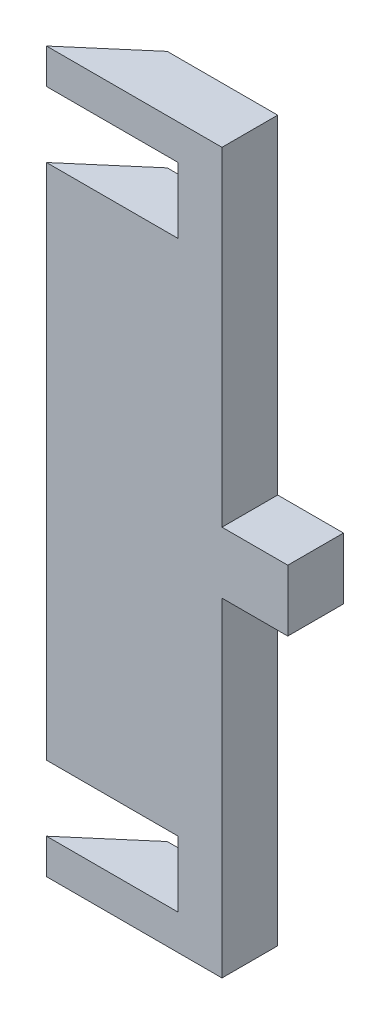
ISO-10303-21;
HEADER;
FILE_DESCRIPTION(('STEP AP214'),'2;1');
FILE_NAME('part.step','',(''),(''),'','','');
FILE_SCHEMA(('AUTOMOTIVE_DESIGN { 1 0 10303 214 1 1 1 1 }'));
ENDSEC;
DATA;
#1=APPLICATION_CONTEXT('core data for automotive mechanical design processes');
#2=APPLICATION_PROTOCOL_DEFINITION('international standard','automotive_design',2000,#1);
#3=PRODUCT_CONTEXT('',#1,'mechanical');
#4=PRODUCT('Part','Part','',(#3));
#5=PRODUCT_RELATED_PRODUCT_CATEGORY('part','',(#4));
#6=PRODUCT_DEFINITION_FORMATION('','',#4);
#7=PRODUCT_DEFINITION_CONTEXT('part definition',#1,'design');
#8=PRODUCT_DEFINITION('design','',#6,#7);
#9=PRODUCT_DEFINITION_SHAPE('','',#8);
#10=(LENGTH_UNIT() NAMED_UNIT(*) SI_UNIT(.MILLI.,.METRE.));
#11=(NAMED_UNIT(*) PLANE_ANGLE_UNIT() SI_UNIT($,.RADIAN.));
#12=(NAMED_UNIT(*) SI_UNIT($,.STERADIAN.) SOLID_ANGLE_UNIT());
#13=UNCERTAINTY_MEASURE_WITH_UNIT(LENGTH_MEASURE(1.E-05),#10,'distance_accuracy_value','');
#14=(GEOMETRIC_REPRESENTATION_CONTEXT(3) GLOBAL_UNCERTAINTY_ASSIGNED_CONTEXT((#13)) GLOBAL_UNIT_ASSIGNED_CONTEXT((#10,
#11,#12)) REPRESENTATION_CONTEXT('',''));
#15=CARTESIAN_POINT('',(0.,0.,0.));
#16=DIRECTION('',(0.,0.,1.));
#17=DIRECTION('',(1.,0.,0.));
#18=AXIS2_PLACEMENT_3D('',#15,#16,#17);
#19=CARTESIAN_POINT('',(60.,170.,0.));
#20=DIRECTION('',(0.,0.,-1.));
#21=DIRECTION('',(-1.,0.,0.));
#22=AXIS2_PLACEMENT_3D('',#19,#20,#21);
#23=PLANE('',#22);
#24=DIRECTION('',(-1.,0.,0.));
#25=VECTOR('',#24,1.);
#26=CARTESIAN_POINT('',(0.,81.,0.));
#27=LINE('',#26,#25);
#28=CARTESIAN_POINT('',(55.,81.,0.));
#29=VERTEX_POINT('',#28);
#30=CARTESIAN_POINT('',(40.,81.,0.));
#31=VERTEX_POINT('',#30);
#32=EDGE_CURVE('E233',#29,#31,#27,.T.);
#33=ORIENTED_EDGE('',*,*,#32,.F.);
#34=DIRECTION('',(0.,-1.,0.));
#35=VECTOR('',#34,1.);
#36=CARTESIAN_POINT('',(55.,95.,0.));
#37=LINE('',#36,#35);
#38=CARTESIAN_POINT('',(55.,95.,0.));
#39=VERTEX_POINT('',#38);
#40=EDGE_CURVE('E227',#39,#29,#37,.T.);
#41=ORIENTED_EDGE('',*,*,#40,.F.);
#42=DIRECTION('',(-1.,0.,0.));
#43=VECTOR('',#42,1.);
#44=CARTESIAN_POINT('',(0.,95.,0.));
#45=LINE('',#44,#43);
#46=CARTESIAN_POINT('',(40.,95.,0.));
#47=VERTEX_POINT('',#46);
#48=EDGE_CURVE('E210',#39,#47,#45,.T.);
#49=ORIENTED_EDGE('',*,*,#48,.T.);
#50=DIRECTION('',(0.,-1.,0.));
#51=VECTOR('',#50,1.);
#52=CARTESIAN_POINT('',(40.,0.,0.));
#53=LINE('',#52,#51);
#54=CARTESIAN_POINT('',(40.,170.,0.));
#55=VERTEX_POINT('',#54);
#56=EDGE_CURVE('E221',#55,#47,#53,.T.);
#57=ORIENTED_EDGE('',*,*,#56,.F.);
#58=DIRECTION('',(1.,0.,0.));
#59=VECTOR('',#58,1.);
#60=CARTESIAN_POINT('',(60.,170.,0.));
#61=LINE('',#60,#59);
#62=CARTESIAN_POINT('',(0.,170.,0.));
#63=VERTEX_POINT('',#62);
#64=EDGE_CURVE('E295',#63,#55,#61,.T.);
#65=ORIENTED_EDGE('',*,*,#64,.F.);
#66=DIRECTION('',(0.,-1.,0.));
#67=VECTOR('',#66,1.);
#68=CARTESIAN_POINT('',(0.,170.,0.));
#69=LINE('',#68,#67);
#70=CARTESIAN_POINT('',(0.,162.,0.));
#71=VERTEX_POINT('',#70);
#72=EDGE_CURVE('E302',#63,#71,#69,.T.);
#73=ORIENTED_EDGE('',*,*,#72,.T.);
#74=DIRECTION('',(1.,0.,0.));
#75=VECTOR('',#74,1.);
#76=CARTESIAN_POINT('',(0.,162.,0.));
#77=LINE('',#76,#75);
#78=CARTESIAN_POINT('',(30.,162.,0.));
#79=VERTEX_POINT('',#78);
#80=EDGE_CURVE('E243',#71,#79,#77,.T.);
#81=ORIENTED_EDGE('',*,*,#80,.T.);
#82=DIRECTION('',(0.,1.,0.));
#83=VECTOR('',#82,1.);
#84=CARTESIAN_POINT('',(30.,0.,0.));
#85=LINE('',#84,#83);
#86=CARTESIAN_POINT('',(30.,147.,0.));
#87=VERTEX_POINT('',#86);
#88=EDGE_CURVE('E238',#87,#79,#85,.T.);
#89=ORIENTED_EDGE('',*,*,#88,.F.);
#90=DIRECTION('',(1.,0.,0.));
#91=VECTOR('',#90,1.);
#92=CARTESIAN_POINT('',(0.,147.,0.));
#93=LINE('',#92,#91);
#94=CARTESIAN_POINT('',(0.,147.,0.));
#95=VERTEX_POINT('',#94);
#96=EDGE_CURVE('E241',#95,#87,#93,.T.);
#97=ORIENTED_EDGE('',*,*,#96,.F.);
#98=CARTESIAN_POINT('',(0.,29.,0.));
#99=VERTEX_POINT('',#98);
#100=EDGE_CURVE('E306',#95,#99,#69,.T.);
#101=ORIENTED_EDGE('',*,*,#100,.T.);
#102=DIRECTION('',(1.,0.,0.));
#103=VECTOR('',#102,1.);
#104=CARTESIAN_POINT('',(0.,29.,0.));
#105=LINE('',#104,#103);
#106=CARTESIAN_POINT('',(30.,29.,0.));
#107=VERTEX_POINT('',#106);
#108=EDGE_CURVE('E259',#99,#107,#105,.T.);
#109=ORIENTED_EDGE('',*,*,#108,.T.);
#110=DIRECTION('',(0.,1.,0.));
#111=VECTOR('',#110,1.);
#112=CARTESIAN_POINT('',(30.,0.,0.));
#113=LINE('',#112,#111);
#114=CARTESIAN_POINT('',(30.,14.,0.));
#115=VERTEX_POINT('',#114);
#116=EDGE_CURVE('E268',#115,#107,#113,.T.);
#117=ORIENTED_EDGE('',*,*,#116,.F.);
#118=DIRECTION('',(1.,0.,0.));
#119=VECTOR('',#118,1.);
#120=CARTESIAN_POINT('',(0.,14.,0.));
#121=LINE('',#120,#119);
#122=CARTESIAN_POINT('',(0.,14.,0.));
#123=VERTEX_POINT('',#122);
#124=EDGE_CURVE('E270',#123,#115,#121,.T.);
#125=ORIENTED_EDGE('',*,*,#124,.F.);
#126=CARTESIAN_POINT('',(0.,6.00000000000001,0.));
#127=VERTEX_POINT('',#126);
#128=EDGE_CURVE('E301',#123,#127,#69,.T.);
#129=ORIENTED_EDGE('',*,*,#128,.T.);
#130=DIRECTION('',(-1.,0.,0.));
#131=VECTOR('',#130,1.);
#132=CARTESIAN_POINT('',(0.,6.00000000000001,0.));
#133=LINE('',#132,#131);
#134=CARTESIAN_POINT('',(40.,6.00000000000001,0.));
#135=VERTEX_POINT('',#134);
#136=EDGE_CURVE('E250',#135,#127,#133,.T.);
#137=ORIENTED_EDGE('',*,*,#136,.F.);
#138=DIRECTION('',(0.,1.,0.));
#139=VECTOR('',#138,1.);
#140=CARTESIAN_POINT('',(40.,0.,0.));
#141=LINE('',#140,#139);
#142=EDGE_CURVE('E252',#135,#31,#141,.T.);
#143=ORIENTED_EDGE('',*,*,#142,.T.);
#144=EDGE_LOOP('',(#33,#41,#49,#57,#65,#73,#81,#89,#97,#101,#109,#117,#125,#129,#137,#143));
#145=FACE_BOUND('',#144,.T.);
#146=ADVANCED_FACE('F98',(#145),#23,.F.);
#147=CARTESIAN_POINT('',(0.,170.,0.));
#148=DIRECTION('',(0.650774217265847,0.,0.759271307334884));
#149=DIRECTION('',(0.759271307334884,0.,-0.650774217265847));
#150=AXIS2_PLACEMENT_3D('',#147,#148,#149);
#151=PLANE('',#150);
#152=DIRECTION('',(0.759271307334884,0.,-0.650774217265847));
#153=VECTOR('',#152,1.);
#154=CARTESIAN_POINT('',(0.,6.00000000000001,0.));
#155=LINE('',#154,#153);
#156=CARTESIAN_POINT('',(14.8173442452375,6.00000000000001,-12.7));
#157=VERTEX_POINT('',#156);
#158=EDGE_CURVE('E120',#127,#157,#155,.T.);
#159=ORIENTED_EDGE('',*,*,#158,.F.);
#160=ORIENTED_EDGE('',*,*,#128,.F.);
#161=DIRECTION('',(-0.759271307334884,0.,0.650774217265847));
#162=VECTOR('',#161,1.);
#163=CARTESIAN_POINT('',(0.,14.,0.));
#164=LINE('',#163,#162);
#165=CARTESIAN_POINT('',(14.8173442452375,14.,-12.7));
#166=VERTEX_POINT('',#165);
#167=EDGE_CURVE('E281',#166,#123,#164,.T.);
#168=ORIENTED_EDGE('',*,*,#167,.F.);
#169=DIRECTION('',(0.,-1.,0.));
#170=VECTOR('',#169,1.);
#171=CARTESIAN_POINT('',(14.8173442452375,170.,-12.7));
#172=LINE('',#171,#170);
#173=EDGE_CURVE('E291',#166,#157,#172,.T.);
#174=ORIENTED_EDGE('',*,*,#173,.T.);
#175=EDGE_LOOP('',(#159,#160,#168,#174));
#176=FACE_BOUND('',#175,.T.);
#177=ADVANCED_FACE('F373',(#176),#151,.F.);
#178=DIRECTION('',(-0.759271307334884,0.,0.650774217265847));
#179=VECTOR('',#178,1.);
#180=CARTESIAN_POINT('',(0.,147.,0.));
#181=LINE('',#180,#179);
#182=CARTESIAN_POINT('',(14.8173442452375,147.,-12.7));
#183=VERTEX_POINT('',#182);
#184=EDGE_CURVE('E283',#183,#95,#181,.T.);
#185=ORIENTED_EDGE('',*,*,#184,.F.);
#186=CARTESIAN_POINT('',(14.8173442452375,29.,-12.7));
#187=VERTEX_POINT('',#186);
#188=EDGE_CURVE('E296',#183,#187,#172,.T.);
#189=ORIENTED_EDGE('',*,*,#188,.T.);
#190=DIRECTION('',(-0.759271307334884,0.,0.650774217265847));
#191=VECTOR('',#190,1.);
#192=CARTESIAN_POINT('',(0.,29.,0.));
#193=LINE('',#192,#191);
#194=EDGE_CURVE('E276',#187,#99,#193,.T.);
#195=ORIENTED_EDGE('',*,*,#194,.T.);
#196=ORIENTED_EDGE('',*,*,#100,.F.);
#197=EDGE_LOOP('',(#185,#189,#195,#196));
#198=FACE_BOUND('',#197,.T.);
#199=ADVANCED_FACE('F364',(#198),#151,.F.);
#200=CARTESIAN_POINT('',(0.,170.,0.));
#201=DIRECTION('',(0.,1.,0.));
#202=DIRECTION('',(0.,0.,1.));
#203=AXIS2_PLACEMENT_3D('',#200,#201,#202);
#204=PLANE('',#203);
#205=ORIENTED_EDGE('',*,*,#64,.T.);
#206=DIRECTION('',(0.,0.,-1.));
#207=VECTOR('',#206,1.);
#208=CARTESIAN_POINT('',(40.,170.,0.));
#209=LINE('',#208,#207);
#210=CARTESIAN_POINT('',(40.,170.,-12.7));
#211=VERTEX_POINT('',#210);
#212=EDGE_CURVE('E220',#55,#211,#209,.T.);
#213=ORIENTED_EDGE('',*,*,#212,.T.);
#214=DIRECTION('',(-1.,0.,0.));
#215=VECTOR('',#214,1.);
#216=CARTESIAN_POINT('',(46.,170.,-12.7));
#217=LINE('',#216,#215);
#218=CARTESIAN_POINT('',(14.8173442452375,170.,-12.7));
#219=VERTEX_POINT('',#218);
#220=EDGE_CURVE('E289',#211,#219,#217,.T.);
#221=ORIENTED_EDGE('',*,*,#220,.T.);
#222=DIRECTION('',(-0.759271307334884,0.,0.650774217265847));
#223=VECTOR('',#222,1.);
#224=CARTESIAN_POINT('',(0.,170.,0.));
#225=LINE('',#224,#223);
#226=EDGE_CURVE('E299',#219,#63,#225,.T.);
#227=ORIENTED_EDGE('',*,*,#226,.T.);
#228=EDGE_LOOP('',(#205,#213,#221,#227));
#229=FACE_BOUND('',#228,.T.);
#230=ADVANCED_FACE('F343',(#229),#204,.T.);
#231=CARTESIAN_POINT('',(46.,170.,-12.7));
#232=DIRECTION('',(0.,0.,1.));
#233=DIRECTION('',(1.,0.,0.));
#234=AXIS2_PLACEMENT_3D('',#231,#232,#233);
#235=PLANE('',#234);
#236=DIRECTION('',(1.,0.,0.));
#237=VECTOR('',#236,1.);
#238=CARTESIAN_POINT('',(46.,81.,-12.7));
#239=LINE('',#238,#237);
#240=CARTESIAN_POINT('',(40.,81.,-12.7));
#241=VERTEX_POINT('',#240);
#242=CARTESIAN_POINT('',(55.,81.,-12.7));
#243=VERTEX_POINT('',#242);
#244=EDGE_CURVE('E12',#241,#243,#239,.T.);
#245=ORIENTED_EDGE('',*,*,#244,.F.);
#246=DIRECTION('',(0.,-1.,0.));
#247=VECTOR('',#246,1.);
#248=CARTESIAN_POINT('',(40.,170.,-12.7));
#249=LINE('',#248,#247);
#250=CARTESIAN_POINT('',(40.,6.00000000000001,-12.7));
#251=VERTEX_POINT('',#250);
#252=EDGE_CURVE('E105',#241,#251,#249,.T.);
#253=ORIENTED_EDGE('',*,*,#252,.T.);
#254=DIRECTION('',(1.,0.,0.));
#255=VECTOR('',#254,1.);
#256=CARTESIAN_POINT('',(46.,6.00000000000001,-12.7));
#257=LINE('',#256,#255);
#258=EDGE_CURVE('E324',#157,#251,#257,.T.);
#259=ORIENTED_EDGE('',*,*,#258,.F.);
#260=ORIENTED_EDGE('',*,*,#173,.F.);
#261=DIRECTION('',(-1.,0.,0.));
#262=VECTOR('',#261,1.);
#263=CARTESIAN_POINT('',(45.9999999999999,14.,-12.7));
#264=LINE('',#263,#262);
#265=CARTESIAN_POINT('',(30.,14.,-12.7));
#266=VERTEX_POINT('',#265);
#267=EDGE_CURVE('E311',#266,#166,#264,.T.);
#268=ORIENTED_EDGE('',*,*,#267,.F.);
#269=DIRECTION('',(0.,-1.,0.));
#270=VECTOR('',#269,1.);
#271=CARTESIAN_POINT('',(30.,170.,-12.7));
#272=LINE('',#271,#270);
#273=CARTESIAN_POINT('',(30.,29.,-12.7));
#274=VERTEX_POINT('',#273);
#275=EDGE_CURVE('E309',#274,#266,#272,.T.);
#276=ORIENTED_EDGE('',*,*,#275,.F.);
#277=DIRECTION('',(-1.,0.,0.));
#278=VECTOR('',#277,1.);
#279=CARTESIAN_POINT('',(46.,29.,-12.7));
#280=LINE('',#279,#278);
#281=EDGE_CURVE('E305',#274,#187,#280,.T.);
#282=ORIENTED_EDGE('',*,*,#281,.T.);
#283=ORIENTED_EDGE('',*,*,#188,.F.);
#284=DIRECTION('',(-1.,0.,0.));
#285=VECTOR('',#284,1.);
#286=CARTESIAN_POINT('',(46.,147.,-12.7));
#287=LINE('',#286,#285);
#288=CARTESIAN_POINT('',(30.,147.,-12.7));
#289=VERTEX_POINT('',#288);
#290=EDGE_CURVE('E313',#289,#183,#287,.T.);
#291=ORIENTED_EDGE('',*,*,#290,.F.);
#292=DIRECTION('',(0.,-1.,0.));
#293=VECTOR('',#292,1.);
#294=CARTESIAN_POINT('',(30.,170.,-12.7));
#295=LINE('',#294,#293);
#296=CARTESIAN_POINT('',(30.,162.,-12.7));
#297=VERTEX_POINT('',#296);
#298=EDGE_CURVE('E315',#297,#289,#295,.T.);
#299=ORIENTED_EDGE('',*,*,#298,.F.);
#300=DIRECTION('',(-1.,0.,0.));
#301=VECTOR('',#300,1.);
#302=CARTESIAN_POINT('',(46.,162.,-12.7));
#303=LINE('',#302,#301);
#304=CARTESIAN_POINT('',(14.8173442452375,162.,-12.7));
#305=VERTEX_POINT('',#304);
#306=EDGE_CURVE('E317',#297,#305,#303,.T.);
#307=ORIENTED_EDGE('',*,*,#306,.T.);
#308=EDGE_CURVE('E292',#219,#305,#172,.T.);
#309=ORIENTED_EDGE('',*,*,#308,.F.);
#310=ORIENTED_EDGE('',*,*,#220,.F.);
#311=DIRECTION('',(0.,1.,0.));
#312=VECTOR('',#311,1.);
#313=CARTESIAN_POINT('',(40.,170.,-12.7));
#314=LINE('',#313,#312);
#315=CARTESIAN_POINT('',(40.,95.,-12.7));
#316=VERTEX_POINT('',#315);
#317=EDGE_CURVE('E322',#316,#211,#314,.T.);
#318=ORIENTED_EDGE('',*,*,#317,.F.);
#319=DIRECTION('',(1.,0.,0.));
#320=VECTOR('',#319,1.);
#321=CARTESIAN_POINT('',(46.,95.,-12.7));
#322=LINE('',#321,#320);
#323=CARTESIAN_POINT('',(55.,95.,-12.7));
#324=VERTEX_POINT('',#323);
#325=EDGE_CURVE('E320',#316,#324,#322,.T.);
#326=ORIENTED_EDGE('',*,*,#325,.T.);
#327=DIRECTION('',(0.,-1.,0.));
#328=VECTOR('',#327,1.);
#329=CARTESIAN_POINT('',(55.,95.,-12.7));
#330=LINE('',#329,#328);
#331=EDGE_CURVE('E229',#324,#243,#330,.T.);
#332=ORIENTED_EDGE('',*,*,#331,.T.);
#333=EDGE_LOOP('',(#245,#253,#259,#260,#268,#276,#282,#283,#291,#299,#307,#309,#310,#318,#326,#332));
#334=FACE_BOUND('',#333,.T.);
#335=ADVANCED_FACE('F328',(#334),#235,.F.);
#336=ORIENTED_EDGE('',*,*,#308,.T.);
#337=DIRECTION('',(-0.759271307334884,0.,0.650774217265847));
#338=VECTOR('',#337,1.);
#339=CARTESIAN_POINT('',(0.,162.,0.));
#340=LINE('',#339,#338);
#341=EDGE_CURVE('E285',#305,#71,#340,.T.);
#342=ORIENTED_EDGE('',*,*,#341,.T.);
#343=ORIENTED_EDGE('',*,*,#72,.F.);
#344=ORIENTED_EDGE('',*,*,#226,.F.);
#345=EDGE_LOOP('',(#336,#342,#343,#344));
#346=FACE_BOUND('',#345,.T.);
#347=ADVANCED_FACE('F348',(#346),#151,.F.);
#348=CARTESIAN_POINT('',(0.,14.,0.));
#349=DIRECTION('',(0.,1.,0.));
#350=DIRECTION('',(-1.,0.,0.));
#351=AXIS2_PLACEMENT_3D('',#348,#349,#350);
#352=PLANE('',#351);
#353=ORIENTED_EDGE('',*,*,#167,.T.);
#354=ORIENTED_EDGE('',*,*,#124,.T.);
#355=DIRECTION('',(0.,0.,-1.));
#356=VECTOR('',#355,1.);
#357=CARTESIAN_POINT('',(30.,14.,0.));
#358=LINE('',#357,#356);
#359=EDGE_CURVE('E273',#115,#266,#358,.T.);
#360=ORIENTED_EDGE('',*,*,#359,.T.);
#361=ORIENTED_EDGE('',*,*,#267,.T.);
#362=EDGE_LOOP('',(#353,#354,#360,#361));
#363=FACE_BOUND('',#362,.T.);
#364=ADVANCED_FACE('F377',(#363),#352,.T.);
#365=CARTESIAN_POINT('',(30.,0.,0.));
#366=DIRECTION('',(-1.,0.,0.));
#367=DIRECTION('',(0.,0.,1.));
#368=AXIS2_PLACEMENT_3D('',#365,#366,#367);
#369=PLANE('',#368);
#370=ORIENTED_EDGE('',*,*,#275,.T.);
#371=ORIENTED_EDGE('',*,*,#359,.F.);
#372=ORIENTED_EDGE('',*,*,#116,.T.);
#373=DIRECTION('',(0.,0.,-1.));
#374=VECTOR('',#373,1.);
#375=CARTESIAN_POINT('',(30.,29.,0.));
#376=LINE('',#375,#374);
#377=EDGE_CURVE('E272',#107,#274,#376,.T.);
#378=ORIENTED_EDGE('',*,*,#377,.T.);
#379=EDGE_LOOP('',(#370,#371,#372,#378));
#380=FACE_BOUND('',#379,.T.);
#381=ADVANCED_FACE('F380',(#380),#369,.T.);
#382=CARTESIAN_POINT('',(0.,29.,0.));
#383=DIRECTION('',(0.,1.,0.));
#384=DIRECTION('',(-1.,0.,0.));
#385=AXIS2_PLACEMENT_3D('',#382,#383,#384);
#386=PLANE('',#385);
#387=ORIENTED_EDGE('',*,*,#281,.F.);
#388=ORIENTED_EDGE('',*,*,#377,.F.);
#389=ORIENTED_EDGE('',*,*,#108,.F.);
#390=ORIENTED_EDGE('',*,*,#194,.F.);
#391=EDGE_LOOP('',(#387,#388,#389,#390));
#392=FACE_BOUND('',#391,.T.);
#393=ADVANCED_FACE('F383',(#392),#386,.F.);
#394=CARTESIAN_POINT('',(30.,0.,0.));
#395=DIRECTION('',(-1.,0.,0.));
#396=DIRECTION('',(0.,0.,1.));
#397=AXIS2_PLACEMENT_3D('',#394,#395,#396);
#398=PLANE('',#397);
#399=ORIENTED_EDGE('',*,*,#298,.T.);
#400=DIRECTION('',(0.,0.,-1.));
#401=VECTOR('',#400,1.);
#402=CARTESIAN_POINT('',(30.,147.,0.));
#403=LINE('',#402,#401);
#404=EDGE_CURVE('E112',#87,#289,#403,.T.);
#405=ORIENTED_EDGE('',*,*,#404,.F.);
#406=ORIENTED_EDGE('',*,*,#88,.T.);
#407=DIRECTION('',(0.,0.,-1.));
#408=VECTOR('',#407,1.);
#409=CARTESIAN_POINT('',(30.,162.,0.));
#410=LINE('',#409,#408);
#411=EDGE_CURVE('E246',#79,#297,#410,.T.);
#412=ORIENTED_EDGE('',*,*,#411,.T.);
#413=EDGE_LOOP('',(#399,#405,#406,#412));
#414=FACE_BOUND('',#413,.T.);
#415=ADVANCED_FACE('F356',(#414),#398,.T.);
#416=CARTESIAN_POINT('',(0.,162.,0.));
#417=DIRECTION('',(0.,1.,0.));
#418=DIRECTION('',(0.,0.,1.));
#419=AXIS2_PLACEMENT_3D('',#416,#417,#418);
#420=PLANE('',#419);
#421=ORIENTED_EDGE('',*,*,#306,.F.);
#422=ORIENTED_EDGE('',*,*,#411,.F.);
#423=ORIENTED_EDGE('',*,*,#80,.F.);
#424=ORIENTED_EDGE('',*,*,#341,.F.);
#425=EDGE_LOOP('',(#421,#422,#423,#424));
#426=FACE_BOUND('',#425,.T.);
#427=ADVANCED_FACE('F353',(#426),#420,.F.);
#428=CARTESIAN_POINT('',(0.,147.,0.));
#429=DIRECTION('',(0.,1.,0.));
#430=DIRECTION('',(0.,0.,1.));
#431=AXIS2_PLACEMENT_3D('',#428,#429,#430);
#432=PLANE('',#431);
#433=ORIENTED_EDGE('',*,*,#184,.T.);
#434=ORIENTED_EDGE('',*,*,#96,.T.);
#435=ORIENTED_EDGE('',*,*,#404,.T.);
#436=ORIENTED_EDGE('',*,*,#290,.T.);
#437=EDGE_LOOP('',(#433,#434,#435,#436));
#438=FACE_BOUND('',#437,.T.);
#439=ADVANCED_FACE('F361',(#438),#432,.T.);
#440=CARTESIAN_POINT('',(40.,0.,0.));
#441=DIRECTION('',(1.,0.,0.));
#442=DIRECTION('',(0.,0.,-1.));
#443=AXIS2_PLACEMENT_3D('',#440,#441,#442);
#444=PLANE('',#443);
#445=ORIENTED_EDGE('',*,*,#317,.T.);
#446=ORIENTED_EDGE('',*,*,#212,.F.);
#447=ORIENTED_EDGE('',*,*,#56,.T.);
#448=DIRECTION('',(0.,0.,-1.));
#449=VECTOR('',#448,1.);
#450=CARTESIAN_POINT('',(40.,95.,0.));
#451=LINE('',#450,#449);
#452=EDGE_CURVE('E216',#47,#316,#451,.T.);
#453=ORIENTED_EDGE('',*,*,#452,.T.);
#454=EDGE_LOOP('',(#445,#446,#447,#453));
#455=FACE_BOUND('',#454,.T.);
#456=ADVANCED_FACE('F340',(#455),#444,.T.);
#457=CARTESIAN_POINT('',(0.,95.,0.));
#458=DIRECTION('',(0.,-1.,0.));
#459=DIRECTION('',(0.,0.,-1.));
#460=AXIS2_PLACEMENT_3D('',#457,#458,#459);
#461=PLANE('',#460);
#462=ORIENTED_EDGE('',*,*,#452,.F.);
#463=ORIENTED_EDGE('',*,*,#48,.F.);
#464=DIRECTION('',(0.,0.,-1.));
#465=VECTOR('',#464,1.);
#466=CARTESIAN_POINT('',(55.,95.,0.));
#467=LINE('',#466,#465);
#468=EDGE_CURVE('E213',#39,#324,#467,.T.);
#469=ORIENTED_EDGE('',*,*,#468,.T.);
#470=ORIENTED_EDGE('',*,*,#325,.F.);
#471=EDGE_LOOP('',(#462,#463,#469,#470));
#472=FACE_BOUND('',#471,.T.);
#473=ADVANCED_FACE('F212',(#472),#461,.F.);
#474=CARTESIAN_POINT('',(0.,81.,0.));
#475=DIRECTION('',(0.,-1.,0.));
#476=DIRECTION('',(0.,0.,-1.));
#477=AXIS2_PLACEMENT_3D('',#474,#475,#476);
#478=PLANE('',#477);
#479=ORIENTED_EDGE('',*,*,#244,.T.);
#480=DIRECTION('',(0.,0.,-1.));
#481=VECTOR('',#480,1.);
#482=CARTESIAN_POINT('',(55.,81.,0.));
#483=LINE('',#482,#481);
#484=EDGE_CURVE('E230',#29,#243,#483,.T.);
#485=ORIENTED_EDGE('',*,*,#484,.F.);
#486=ORIENTED_EDGE('',*,*,#32,.T.);
#487=DIRECTION('',(0.,0.,-1.));
#488=VECTOR('',#487,1.);
#489=CARTESIAN_POINT('',(40.,81.,0.));
#490=LINE('',#489,#488);
#491=EDGE_CURVE('E256',#31,#241,#490,.T.);
#492=ORIENTED_EDGE('',*,*,#491,.T.);
#493=EDGE_LOOP('',(#479,#485,#486,#492));
#494=FACE_BOUND('',#493,.T.);
#495=ADVANCED_FACE('F336',(#494),#478,.T.);
#496=CARTESIAN_POINT('',(40.,0.,0.));
#497=DIRECTION('',(-1.,0.,0.));
#498=DIRECTION('',(0.,0.,1.));
#499=AXIS2_PLACEMENT_3D('',#496,#497,#498);
#500=PLANE('',#499);
#501=ORIENTED_EDGE('',*,*,#491,.F.);
#502=ORIENTED_EDGE('',*,*,#142,.F.);
#503=DIRECTION('',(0.,0.,-1.));
#504=VECTOR('',#503,1.);
#505=CARTESIAN_POINT('',(40.,6.00000000000001,0.));
#506=LINE('',#505,#504);
#507=EDGE_CURVE('E255',#135,#251,#506,.T.);
#508=ORIENTED_EDGE('',*,*,#507,.T.);
#509=ORIENTED_EDGE('',*,*,#252,.F.);
#510=EDGE_LOOP('',(#501,#502,#508,#509));
#511=FACE_BOUND('',#510,.T.);
#512=ADVANCED_FACE('F333',(#511),#500,.F.);
#513=CARTESIAN_POINT('',(0.,6.00000000000001,0.));
#514=DIRECTION('',(0.,-1.,0.));
#515=DIRECTION('',(0.,0.,-1.));
#516=AXIS2_PLACEMENT_3D('',#513,#514,#515);
#517=PLANE('',#516);
#518=ORIENTED_EDGE('',*,*,#158,.T.);
#519=ORIENTED_EDGE('',*,*,#258,.T.);
#520=ORIENTED_EDGE('',*,*,#507,.F.);
#521=ORIENTED_EDGE('',*,*,#136,.T.);
#522=EDGE_LOOP('',(#518,#519,#520,#521));
#523=FACE_BOUND('',#522,.T.);
#524=ADVANCED_FACE('F496',(#523),#517,.T.);
#525=CARTESIAN_POINT('',(55.,95.,0.));
#526=DIRECTION('',(1.,0.,0.));
#527=DIRECTION('',(0.,0.,-1.));
#528=AXIS2_PLACEMENT_3D('',#525,#526,#527);
#529=PLANE('',#528);
#530=ORIENTED_EDGE('',*,*,#331,.F.);
#531=ORIENTED_EDGE('',*,*,#468,.F.);
#532=ORIENTED_EDGE('',*,*,#40,.T.);
#533=ORIENTED_EDGE('',*,*,#484,.T.);
#534=EDGE_LOOP('',(#530,#531,#532,#533));
#535=FACE_BOUND('',#534,.T.);
#536=ADVANCED_FACE('F225',(#535),#529,.T.);
#537=CLOSED_SHELL('',(#146,#177,#199,#230,#335,#347,#364,#381,#393,#415,#427,#439,#456,#473,
#495,#512,#524,#536));
#538=MANIFOLD_SOLID_BREP('B2',#537);
#539=ADVANCED_BREP_SHAPE_REPRESENTATION('',(#18,#538),#14);
#540=SHAPE_DEFINITION_REPRESENTATION(#9,#539);
ENDSEC;
END-ISO-10303-21;
